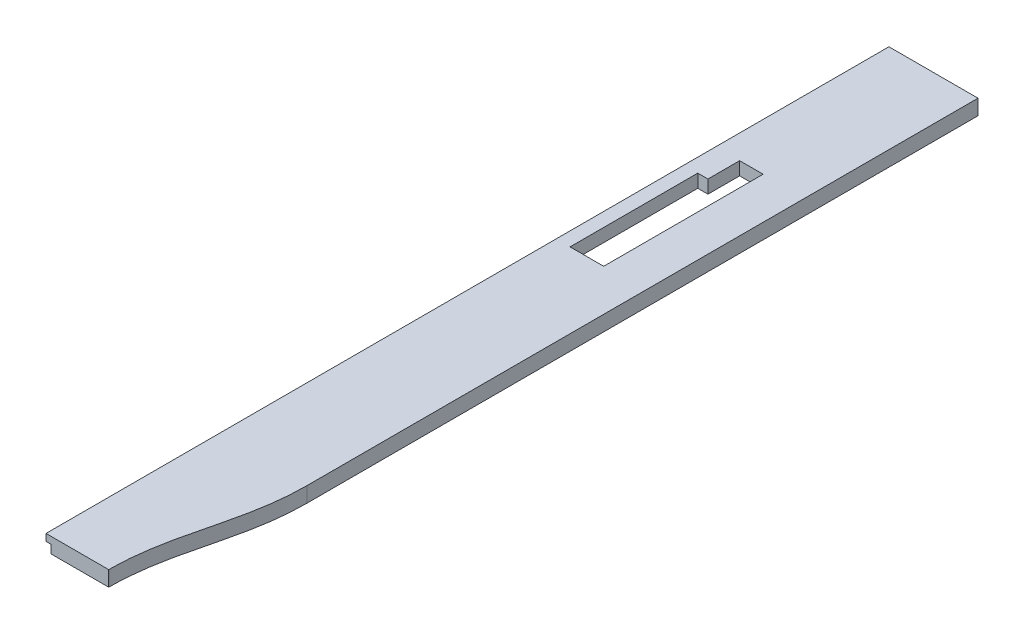
ISO-10303-21;
HEADER;
FILE_DESCRIPTION(('STEP AP214'),'2;1');
FILE_NAME('part.step','',(''),(''),'','','');
FILE_SCHEMA(('AUTOMOTIVE_DESIGN { 1 0 10303 214 1 1 1 1 }'));
ENDSEC;
DATA;
#1=APPLICATION_CONTEXT('core data for automotive mechanical design processes');
#2=APPLICATION_PROTOCOL_DEFINITION('international standard','automotive_design',2000,#1);
#3=PRODUCT_CONTEXT('',#1,'mechanical');
#4=PRODUCT('Part','Part','',(#3));
#5=PRODUCT_RELATED_PRODUCT_CATEGORY('part','',(#4));
#6=PRODUCT_DEFINITION_FORMATION('','',#4);
#7=PRODUCT_DEFINITION_CONTEXT('part definition',#1,'design');
#8=PRODUCT_DEFINITION('design','',#6,#7);
#9=PRODUCT_DEFINITION_SHAPE('','',#8);
#10=(LENGTH_UNIT() NAMED_UNIT(*) SI_UNIT(.MILLI.,.METRE.));
#11=(NAMED_UNIT(*) PLANE_ANGLE_UNIT() SI_UNIT($,.RADIAN.));
#12=(NAMED_UNIT(*) SI_UNIT($,.STERADIAN.) SOLID_ANGLE_UNIT());
#13=UNCERTAINTY_MEASURE_WITH_UNIT(LENGTH_MEASURE(1.E-05),#10,'distance_accuracy_value','');
#14=(GEOMETRIC_REPRESENTATION_CONTEXT(3) GLOBAL_UNCERTAINTY_ASSIGNED_CONTEXT((#13)) GLOBAL_UNIT_ASSIGNED_CONTEXT((#10,
#11,#12)) REPRESENTATION_CONTEXT('',''));
#15=CARTESIAN_POINT('',(0.,0.,0.));
#16=DIRECTION('',(0.,0.,1.));
#17=DIRECTION('',(1.,0.,0.));
#18=AXIS2_PLACEMENT_3D('',#15,#16,#17);
#19=CARTESIAN_POINT('',(0.,-484.,1346.36966671738));
#20=DIRECTION('',(1.,0.,0.));
#21=DIRECTION('',(0.,0.,-1.));
#22=AXIS2_PLACEMENT_3D('',#19,#20,#21);
#23=PLANE('',#22);
#24=DIRECTION('',(0.,0.,-1.));
#25=VECTOR('',#24,1.);
#26=CARTESIAN_POINT('',(0.,-506.,1346.36966671738));
#27=LINE('',#26,#25);
#28=CARTESIAN_POINT('',(0.,-506.,1004.));
#29=VERTEX_POINT('',#28);
#30=CARTESIAN_POINT('',(0.,-506.,0.));
#31=VERTEX_POINT('',#30);
#32=EDGE_CURVE('E391',#29,#31,#27,.T.);
#33=ORIENTED_EDGE('',*,*,#32,.F.);
#34=DIRECTION('',(0.,-1.,0.));
#35=VECTOR('',#34,1.);
#36=CARTESIAN_POINT('',(0.,-506.,1004.));
#37=LINE('',#36,#35);
#38=CARTESIAN_POINT('',(0.,-494.,1004.));
#39=VERTEX_POINT('',#38);
#40=EDGE_CURVE('E291',#39,#29,#37,.T.);
#41=ORIENTED_EDGE('',*,*,#40,.F.);
#42=DIRECTION('',(0.,0.,-1.));
#43=VECTOR('',#42,1.);
#44=CARTESIAN_POINT('',(0.,-494.,1004.));
#45=LINE('',#44,#43);
#46=CARTESIAN_POINT('',(0.,-494.,1216.));
#47=VERTEX_POINT('',#46);
#48=EDGE_CURVE('E310',#47,#39,#45,.T.);
#49=ORIENTED_EDGE('',*,*,#48,.F.);
#50=DIRECTION('',(0.,1.,0.));
#51=VECTOR('',#50,1.);
#52=CARTESIAN_POINT('',(0.,-484.,1216.));
#53=LINE('',#52,#51);
#54=CARTESIAN_POINT('',(0.,-484.,1216.));
#55=VERTEX_POINT('',#54);
#56=EDGE_CURVE('E40',#47,#55,#53,.T.);
#57=ORIENTED_EDGE('',*,*,#56,.T.);
#58=DIRECTION('',(0.,0.,-1.));
#59=VECTOR('',#58,1.);
#60=CARTESIAN_POINT('',(0.,-484.,1346.36966671738));
#61=LINE('',#60,#59);
#62=CARTESIAN_POINT('',(0.,-484.,0.));
#63=VERTEX_POINT('',#62);
#64=EDGE_CURVE('E640',#55,#63,#61,.T.);
#65=ORIENTED_EDGE('',*,*,#64,.T.);
#66=DIRECTION('',(0.,-1.,0.));
#67=VECTOR('',#66,1.);
#68=CARTESIAN_POINT('',(0.,-484.,0.));
#69=LINE('',#68,#67);
#70=EDGE_CURVE('E658',#63,#31,#69,.T.);
#71=ORIENTED_EDGE('',*,*,#70,.T.);
#72=EDGE_LOOP('',(#33,#41,#49,#57,#65,#71));
#73=FACE_BOUND('',#72,.T.);
#74=ADVANCED_FACE('F33',(#73),#23,.F.);
#75=CARTESIAN_POINT('',(0.,-506.,1346.36966671738));
#76=DIRECTION('',(0.,1.,0.));
#77=DIRECTION('',(0.,0.,1.));
#78=AXIS2_PLACEMENT_3D('',#75,#76,#77);
#79=PLANE('',#78);
#80=DIRECTION('',(0.,0.,-1.));
#81=VECTOR('',#80,1.);
#82=CARTESIAN_POINT('',(10.,-506.,480.));
#83=LINE('',#82,#81);
#84=CARTESIAN_POINT('',(10.,-506.,480.));
#85=VERTEX_POINT('',#84);
#86=CARTESIAN_POINT('',(10.,-506.,250.));
#87=VERTEX_POINT('',#86);
#88=EDGE_CURVE('E269',#85,#87,#83,.T.);
#89=ORIENTED_EDGE('',*,*,#88,.F.);
#90=CARTESIAN_POINT('',(20.,-506.,480.));
#91=DIRECTION('',(0.,-1.,0.));
#92=DIRECTION('',(0.,0.,-1.));
#93=AXIS2_PLACEMENT_3D('',#90,#91,#92);
#94=CIRCLE('',#93,10.);
#95=CARTESIAN_POINT('',(20.0000000000001,-506.,490.));
#96=VERTEX_POINT('',#95);
#97=EDGE_CURVE('E234',#96,#85,#94,.T.);
#98=ORIENTED_EDGE('',*,*,#97,.F.);
#99=DIRECTION('',(-1.,0.,0.));
#100=VECTOR('',#99,1.);
#101=CARTESIAN_POINT('',(68.4999999999996,-506.,490.));
#102=LINE('',#101,#100);
#103=CARTESIAN_POINT('',(68.4999999999996,-506.,490.));
#104=VERTEX_POINT('',#103);
#105=EDGE_CURVE('E246',#104,#96,#102,.T.);
#106=ORIENTED_EDGE('',*,*,#105,.F.);
#107=CARTESIAN_POINT('',(68.4999999999997,-506.,480.));
#108=DIRECTION('',(0.,-1.,0.));
#109=DIRECTION('',(0.,0.,-1.));
#110=AXIS2_PLACEMENT_3D('',#107,#108,#109);
#111=CIRCLE('',#110,10.);
#112=CARTESIAN_POINT('',(78.4999999999997,-506.,480.));
#113=VERTEX_POINT('',#112);
#114=EDGE_CURVE('E284',#113,#104,#111,.T.);
#115=ORIENTED_EDGE('',*,*,#114,.F.);
#116=DIRECTION('',(0.,0.,1.));
#117=VECTOR('',#116,1.);
#118=CARTESIAN_POINT('',(78.4999999999997,-506.,250.));
#119=LINE('',#118,#117);
#120=CARTESIAN_POINT('',(78.4999999999997,-506.,250.));
#121=VERTEX_POINT('',#120);
#122=EDGE_CURVE('E281',#121,#113,#119,.T.);
#123=ORIENTED_EDGE('',*,*,#122,.F.);
#124=CARTESIAN_POINT('',(68.4999999999997,-506.,250.));
#125=DIRECTION('',(0.,-1.,0.));
#126=DIRECTION('',(0.,0.,-1.));
#127=AXIS2_PLACEMENT_3D('',#124,#125,#126);
#128=CIRCLE('',#127,10.);
#129=CARTESIAN_POINT('',(68.4999999999996,-506.,240.));
#130=VERTEX_POINT('',#129);
#131=EDGE_CURVE('E278',#130,#121,#128,.T.);
#132=ORIENTED_EDGE('',*,*,#131,.F.);
#133=DIRECTION('',(1.,0.,0.));
#134=VECTOR('',#133,1.);
#135=CARTESIAN_POINT('',(20.0000000000001,-506.,240.));
#136=LINE('',#135,#134);
#137=CARTESIAN_POINT('',(20.0000000000001,-506.,240.));
#138=VERTEX_POINT('',#137);
#139=EDGE_CURVE('E275',#138,#130,#136,.T.);
#140=ORIENTED_EDGE('',*,*,#139,.F.);
#141=CARTESIAN_POINT('',(20.0000000000001,-506.,250.));
#142=DIRECTION('',(0.,-1.,0.));
#143=DIRECTION('',(0.,0.,-1.));
#144=AXIS2_PLACEMENT_3D('',#141,#142,#143);
#145=CIRCLE('',#144,10.);
#146=EDGE_CURVE('E272',#87,#138,#145,.T.);
#147=ORIENTED_EDGE('',*,*,#146,.F.);
#148=EDGE_LOOP('',(#89,#98,#106,#115,#123,#132,#140,#147));
#149=FACE_BOUND('',#148,.T.);
#150=DIRECTION('',(0.,0.,1.));
#151=VECTOR('',#150,1.);
#152=CARTESIAN_POINT('',(7.00000000000006,-506.,1004.));
#153=LINE('',#152,#151);
#154=CARTESIAN_POINT('',(7.00000000000006,-506.,1004.));
#155=VERTEX_POINT('',#154);
#156=CARTESIAN_POINT('',(7.00000000000007,-506.,1216.));
#157=VERTEX_POINT('',#156);
#158=EDGE_CURVE('E309',#155,#157,#153,.T.);
#159=ORIENTED_EDGE('',*,*,#158,.F.);
#160=DIRECTION('',(-1.,0.,0.));
#161=VECTOR('',#160,1.);
#162=CARTESIAN_POINT('',(7.00000000000006,-506.,1004.));
#163=LINE('',#162,#161);
#164=EDGE_CURVE('E317',#155,#29,#163,.T.);
#165=ORIENTED_EDGE('',*,*,#164,.T.);
#166=ORIENTED_EDGE('',*,*,#32,.T.);
#167=DIRECTION('',(1.,0.,0.));
#168=VECTOR('',#167,1.);
#169=CARTESIAN_POINT('',(0.,-506.,0.));
#170=LINE('',#169,#168);
#171=CARTESIAN_POINT('',(128.5,-506.,0.));
#172=VERTEX_POINT('',#171);
#173=EDGE_CURVE('E660',#31,#172,#170,.T.);
#174=ORIENTED_EDGE('',*,*,#173,.T.);
#175=DIRECTION('',(0.,0.,-1.));
#176=VECTOR('',#175,1.);
#177=CARTESIAN_POINT('',(128.5,-506.,1346.36966671738));
#178=LINE('',#177,#176);
#179=CARTESIAN_POINT('',(128.5,-506.,968.));
#180=VERTEX_POINT('',#179);
#181=EDGE_CURVE('E646',#180,#172,#178,.T.);
#182=ORIENTED_EDGE('',*,*,#181,.F.);
#183=CARTESIAN_POINT('',(128.5,-506.,968.));
#184=CARTESIAN_POINT('',(128.5,-506.,1061.33333333333));
#185=CARTESIAN_POINT('',(90.4999999999999,-506.,1122.56666666667));
#186=CARTESIAN_POINT('',(90.4999999999999,-506.,1215.9));
#187=B_SPLINE_CURVE_WITH_KNOTS('',3,(#183,#184,#185,#186),.UNSPECIFIED.,.F.,.F.,(4,4),(0.,1.),.UNSPECIFIED.);
#188=CARTESIAN_POINT('',(90.4999999999999,-506.,1215.9));
#189=VERTEX_POINT('',#188);
#190=EDGE_CURVE('E328',#180,#189,#187,.T.);
#191=ORIENTED_EDGE('',*,*,#190,.T.);
#192=DIRECTION('',(0.,0.,1.));
#193=VECTOR('',#192,1.);
#194=CARTESIAN_POINT('',(90.4999999999999,-506.,1215.9));
#195=LINE('',#194,#193);
#196=CARTESIAN_POINT('',(90.4999999999999,-506.,1216.));
#197=VERTEX_POINT('',#196);
#198=EDGE_CURVE('E334',#189,#197,#195,.T.);
#199=ORIENTED_EDGE('',*,*,#198,.T.);
#200=DIRECTION('',(-1.,0.,0.));
#201=VECTOR('',#200,1.);
#202=CARTESIAN_POINT('',(0.,-506.,1216.));
#203=LINE('',#202,#201);
#204=EDGE_CURVE('E377',#197,#157,#203,.T.);
#205=ORIENTED_EDGE('',*,*,#204,.T.);
#206=EDGE_LOOP('',(#159,#165,#166,#174,#182,#191,#199,#205));
#207=FACE_BOUND('',#206,.T.);
#208=ADVANCED_FACE('F360',(#149,#207),#79,.F.);
#209=CARTESIAN_POINT('',(128.5,-484.,1346.36966671738));
#210=DIRECTION('',(1.,0.,0.));
#211=DIRECTION('',(0.,0.,-1.));
#212=AXIS2_PLACEMENT_3D('',#209,#210,#211);
#213=PLANE('',#212);
#214=DIRECTION('',(0.,1.,0.));
#215=VECTOR('',#214,1.);
#216=CARTESIAN_POINT('',(128.5,-506.,968.));
#217=LINE('',#216,#215);
#218=CARTESIAN_POINT('',(128.5,-484.,968.));
#219=VERTEX_POINT('',#218);
#220=EDGE_CURVE('E637',#180,#219,#217,.T.);
#221=ORIENTED_EDGE('',*,*,#220,.F.);
#222=ORIENTED_EDGE('',*,*,#181,.T.);
#223=DIRECTION('',(0.,-1.,0.));
#224=VECTOR('',#223,1.);
#225=CARTESIAN_POINT('',(128.5,-484.,0.));
#226=LINE('',#225,#224);
#227=CARTESIAN_POINT('',(128.5,-484.,0.));
#228=VERTEX_POINT('',#227);
#229=EDGE_CURVE('E648',#228,#172,#226,.T.);
#230=ORIENTED_EDGE('',*,*,#229,.F.);
#231=DIRECTION('',(0.,0.,-1.));
#232=VECTOR('',#231,1.);
#233=CARTESIAN_POINT('',(128.5,-484.,1346.36966671738));
#234=LINE('',#233,#232);
#235=EDGE_CURVE('E644',#219,#228,#234,.T.);
#236=ORIENTED_EDGE('',*,*,#235,.F.);
#237=EDGE_LOOP('',(#221,#222,#230,#236));
#238=FACE_BOUND('',#237,.T.);
#239=ADVANCED_FACE('F358',(#238),#213,.T.);
#240=CARTESIAN_POINT('',(0.,-484.,1346.36966671738));
#241=DIRECTION('',(0.,1.,0.));
#242=DIRECTION('',(0.,0.,1.));
#243=AXIS2_PLACEMENT_3D('',#240,#241,#242);
#244=PLANE('',#243);
#245=DIRECTION('',(0.,0.,1.));
#246=VECTOR('',#245,1.);
#247=CARTESIAN_POINT('',(68.4999999999997,-484.,250.));
#248=LINE('',#247,#246);
#249=CARTESIAN_POINT('',(68.4999999999997,-484.,250.));
#250=VERTEX_POINT('',#249);
#251=CARTESIAN_POINT('',(68.4999999999997,-484.,480.));
#252=VERTEX_POINT('',#251);
#253=EDGE_CURVE('E191',#250,#252,#248,.T.);
#254=ORIENTED_EDGE('',*,*,#253,.T.);
#255=DIRECTION('',(-1.,0.,0.));
#256=VECTOR('',#255,1.);
#257=CARTESIAN_POINT('',(68.4999999999997,-484.,480.));
#258=LINE('',#257,#256);
#259=CARTESIAN_POINT('',(20.,-484.,480.));
#260=VERTEX_POINT('',#259);
#261=EDGE_CURVE('E202',#252,#260,#258,.T.);
#262=ORIENTED_EDGE('',*,*,#261,.T.);
#263=DIRECTION('',(0.,0.,-1.));
#264=VECTOR('',#263,1.);
#265=CARTESIAN_POINT('',(20.,-484.,480.));
#266=LINE('',#265,#264);
#267=CARTESIAN_POINT('',(20.0000000000001,-484.,295.75));
#268=VERTEX_POINT('',#267);
#269=EDGE_CURVE('E55',#260,#268,#266,.T.);
#270=ORIENTED_EDGE('',*,*,#269,.T.);
#271=DIRECTION('',(1.,0.,0.));
#272=VECTOR('',#271,1.);
#273=CARTESIAN_POINT('',(20.0000000000001,-484.,295.75));
#274=LINE('',#273,#272);
#275=CARTESIAN_POINT('',(34.65,-484.,295.75));
#276=VERTEX_POINT('',#275);
#277=EDGE_CURVE('E216',#268,#276,#274,.T.);
#278=ORIENTED_EDGE('',*,*,#277,.T.);
#279=DIRECTION('',(0.,0.,-1.));
#280=VECTOR('',#279,1.);
#281=CARTESIAN_POINT('',(34.65,-484.,295.75));
#282=LINE('',#281,#280);
#283=CARTESIAN_POINT('',(34.6500000000001,-484.,250.));
#284=VERTEX_POINT('',#283);
#285=EDGE_CURVE('E219',#276,#284,#282,.T.);
#286=ORIENTED_EDGE('',*,*,#285,.T.);
#287=DIRECTION('',(1.,0.,0.));
#288=VECTOR('',#287,1.);
#289=CARTESIAN_POINT('',(34.6500000000001,-484.,250.));
#290=LINE('',#289,#288);
#291=EDGE_CURVE('E199',#284,#250,#290,.T.);
#292=ORIENTED_EDGE('',*,*,#291,.T.);
#293=EDGE_LOOP('',(#254,#262,#270,#278,#286,#292));
#294=FACE_BOUND('',#293,.T.);
#295=CARTESIAN_POINT('',(128.5,-484.,968.));
#296=CARTESIAN_POINT('',(128.5,-484.,1061.33333333333));
#297=CARTESIAN_POINT('',(90.4999999999999,-484.,1122.56666666667));
#298=CARTESIAN_POINT('',(90.4999999999999,-484.,1215.9));
#299=B_SPLINE_CURVE_WITH_KNOTS('',3,(#295,#296,#297,#298),.UNSPECIFIED.,.F.,.F.,(4,4),(0.,1.),.UNSPECIFIED.);
#300=CARTESIAN_POINT('',(90.4999999999999,-484.,1215.9));
#301=VERTEX_POINT('',#300);
#302=EDGE_CURVE('E323',#219,#301,#299,.T.);
#303=ORIENTED_EDGE('',*,*,#302,.F.);
#304=ORIENTED_EDGE('',*,*,#235,.T.);
#305=DIRECTION('',(1.,0.,0.));
#306=VECTOR('',#305,1.);
#307=CARTESIAN_POINT('',(0.,-484.,0.));
#308=LINE('',#307,#306);
#309=EDGE_CURVE('E642',#63,#228,#308,.T.);
#310=ORIENTED_EDGE('',*,*,#309,.F.);
#311=ORIENTED_EDGE('',*,*,#64,.F.);
#312=DIRECTION('',(-1.,0.,0.));
#313=VECTOR('',#312,1.);
#314=CARTESIAN_POINT('',(0.,-484.,1216.));
#315=LINE('',#314,#313);
#316=CARTESIAN_POINT('',(90.4999999999999,-484.,1216.));
#317=VERTEX_POINT('',#316);
#318=EDGE_CURVE('E11',#317,#55,#315,.T.);
#319=ORIENTED_EDGE('',*,*,#318,.F.);
#320=DIRECTION('',(0.,0.,1.));
#321=VECTOR('',#320,1.);
#322=CARTESIAN_POINT('',(90.4999999999999,-484.,1215.9));
#323=LINE('',#322,#321);
#324=EDGE_CURVE('E335',#301,#317,#323,.T.);
#325=ORIENTED_EDGE('',*,*,#324,.F.);
#326=EDGE_LOOP('',(#303,#304,#310,#311,#319,#325));
#327=FACE_BOUND('',#326,.T.);
#328=ADVANCED_FACE('F206',(#294,#327),#244,.T.);
#329=CARTESIAN_POINT('',(0.,0.,0.));
#330=DIRECTION('',(0.,0.,1.));
#331=DIRECTION('',(1.,0.,0.));
#332=AXIS2_PLACEMENT_3D('',#329,#330,#331);
#333=PLANE('',#332);
#334=ORIENTED_EDGE('',*,*,#70,.F.);
#335=ORIENTED_EDGE('',*,*,#309,.T.);
#336=ORIENTED_EDGE('',*,*,#229,.T.);
#337=ORIENTED_EDGE('',*,*,#173,.F.);
#338=EDGE_LOOP('',(#334,#335,#336,#337));
#339=FACE_BOUND('',#338,.T.);
#340=ADVANCED_FACE('F351',(#339),#333,.F.);
#341=CARTESIAN_POINT('',(80.4999999999999,-222.999999999999,1216.));
#342=DIRECTION('',(0.,0.,-1.));
#343=DIRECTION('',(0.,1.,0.));
#344=AXIS2_PLACEMENT_3D('',#341,#342,#343);
#345=PLANE('',#344);
#346=ORIENTED_EDGE('',*,*,#56,.F.);
#347=DIRECTION('',(-1.,0.,0.));
#348=VECTOR('',#347,1.);
#349=CARTESIAN_POINT('',(7.00000000000006,-494.,1216.));
#350=LINE('',#349,#348);
#351=CARTESIAN_POINT('',(7.00000000000006,-494.,1216.));
#352=VERTEX_POINT('',#351);
#353=EDGE_CURVE('E324',#352,#47,#350,.T.);
#354=ORIENTED_EDGE('',*,*,#353,.F.);
#355=DIRECTION('',(0.,1.,0.));
#356=VECTOR('',#355,1.);
#357=CARTESIAN_POINT('',(7.00000000000006,-506.,1216.));
#358=LINE('',#357,#356);
#359=EDGE_CURVE('E312',#157,#352,#358,.T.);
#360=ORIENTED_EDGE('',*,*,#359,.F.);
#361=ORIENTED_EDGE('',*,*,#204,.F.);
#362=DIRECTION('',(0.,1.,0.));
#363=VECTOR('',#362,1.);
#364=CARTESIAN_POINT('',(90.4999999999999,-506.,1216.));
#365=LINE('',#364,#363);
#366=EDGE_CURVE('E630',#197,#317,#365,.T.);
#367=ORIENTED_EDGE('',*,*,#366,.T.);
#368=ORIENTED_EDGE('',*,*,#318,.T.);
#369=EDGE_LOOP('',(#346,#354,#360,#361,#367,#368));
#370=FACE_BOUND('',#369,.T.);
#371=ADVANCED_FACE('F346',(#370),#345,.F.);
#372=DIRECTION('',(0.,1.,0.));
#373=VECTOR('',#372,1.);
#374=SURFACE_OF_LINEAR_EXTRUSION('',#187,#373);
#375=ORIENTED_EDGE('',*,*,#302,.T.);
#376=DIRECTION('',(0.,1.,0.));
#377=VECTOR('',#376,1.);
#378=CARTESIAN_POINT('',(90.4999999999999,-506.,1215.9));
#379=LINE('',#378,#377);
#380=EDGE_CURVE('E631',#189,#301,#379,.T.);
#381=ORIENTED_EDGE('',*,*,#380,.F.);
#382=ORIENTED_EDGE('',*,*,#190,.F.);
#383=ORIENTED_EDGE('',*,*,#220,.T.);
#384=EDGE_LOOP('',(#375,#381,#382,#383));
#385=FACE_BOUND('',#384,.T.);
#386=ADVANCED_FACE('F341',(#385),#374,.F.);
#387=CARTESIAN_POINT('',(90.4999999999999,-506.,1215.9));
#388=DIRECTION('',(-1.,0.,0.));
#389=DIRECTION('',(0.,0.,1.));
#390=AXIS2_PLACEMENT_3D('',#387,#388,#389);
#391=PLANE('',#390);
#392=ORIENTED_EDGE('',*,*,#324,.T.);
#393=ORIENTED_EDGE('',*,*,#366,.F.);
#394=ORIENTED_EDGE('',*,*,#198,.F.);
#395=ORIENTED_EDGE('',*,*,#380,.T.);
#396=EDGE_LOOP('',(#392,#393,#394,#395));
#397=FACE_BOUND('',#396,.T.);
#398=ADVANCED_FACE('F345',(#397),#391,.F.);
#399=CARTESIAN_POINT('',(7.00000000000006,-506.,1004.));
#400=DIRECTION('',(0.,0.,-1.));
#401=DIRECTION('',(-1.,0.,0.));
#402=AXIS2_PLACEMENT_3D('',#399,#400,#401);
#403=PLANE('',#402);
#404=ORIENTED_EDGE('',*,*,#40,.T.);
#405=ORIENTED_EDGE('',*,*,#164,.F.);
#406=DIRECTION('',(0.,-1.,0.));
#407=VECTOR('',#406,1.);
#408=CARTESIAN_POINT('',(7.00000000000006,-506.,1004.));
#409=LINE('',#408,#407);
#410=CARTESIAN_POINT('',(7.00000000000006,-494.,1004.));
#411=VERTEX_POINT('',#410);
#412=EDGE_CURVE('E306',#411,#155,#409,.T.);
#413=ORIENTED_EDGE('',*,*,#412,.F.);
#414=DIRECTION('',(-1.,0.,0.));
#415=VECTOR('',#414,1.);
#416=CARTESIAN_POINT('',(7.00000000000006,-494.,1004.));
#417=LINE('',#416,#415);
#418=EDGE_CURVE('E321',#411,#39,#417,.T.);
#419=ORIENTED_EDGE('',*,*,#418,.T.);
#420=EDGE_LOOP('',(#404,#405,#413,#419));
#421=FACE_BOUND('',#420,.T.);
#422=ADVANCED_FACE('F393',(#421),#403,.F.);
#423=CARTESIAN_POINT('',(7.00000000000006,-494.,1004.));
#424=DIRECTION('',(0.,1.,0.));
#425=DIRECTION('',(-1.,0.,0.));
#426=AXIS2_PLACEMENT_3D('',#423,#424,#425);
#427=PLANE('',#426);
#428=ORIENTED_EDGE('',*,*,#48,.T.);
#429=ORIENTED_EDGE('',*,*,#418,.F.);
#430=DIRECTION('',(0.,0.,-1.));
#431=VECTOR('',#430,1.);
#432=CARTESIAN_POINT('',(7.00000000000006,-494.,1004.));
#433=LINE('',#432,#431);
#434=EDGE_CURVE('E314',#352,#411,#433,.T.);
#435=ORIENTED_EDGE('',*,*,#434,.F.);
#436=ORIENTED_EDGE('',*,*,#353,.T.);
#437=EDGE_LOOP('',(#428,#429,#435,#436));
#438=FACE_BOUND('',#437,.T.);
#439=ADVANCED_FACE('F388',(#438),#427,.F.);
#440=CARTESIAN_POINT('',(7.,0.,0.));
#441=DIRECTION('',(1.,0.,0.));
#442=DIRECTION('',(0.,1.,0.));
#443=AXIS2_PLACEMENT_3D('',#440,#441,#442);
#444=PLANE('',#443);
#445=ORIENTED_EDGE('',*,*,#412,.T.);
#446=ORIENTED_EDGE('',*,*,#158,.T.);
#447=ORIENTED_EDGE('',*,*,#359,.T.);
#448=ORIENTED_EDGE('',*,*,#434,.T.);
#449=EDGE_LOOP('',(#445,#446,#447,#448));
#450=FACE_BOUND('',#449,.T.);
#451=ADVANCED_FACE('F380',(#450),#444,.F.);
#452=CARTESIAN_POINT('',(20.,-503.,480.));
#453=DIRECTION('',(0.,-1.,0.));
#454=DIRECTION('',(0.,0.,-1.));
#455=AXIS2_PLACEMENT_3D('',#452,#453,#454);
#456=CYLINDRICAL_SURFACE('',#455,10.);
#457=ORIENTED_EDGE('',*,*,#97,.T.);
#458=DIRECTION('',(0.,-1.,0.));
#459=VECTOR('',#458,1.);
#460=CARTESIAN_POINT('',(10.,-503.,480.));
#461=LINE('',#460,#459);
#462=CARTESIAN_POINT('',(10.,-503.,480.));
#463=VERTEX_POINT('',#462);
#464=EDGE_CURVE('E267',#463,#85,#461,.T.);
#465=ORIENTED_EDGE('',*,*,#464,.F.);
#466=CARTESIAN_POINT('',(20.,-503.,480.));
#467=DIRECTION('',(0.,-1.,0.));
#468=DIRECTION('',(0.,0.,-1.));
#469=AXIS2_PLACEMENT_3D('',#466,#467,#468);
#470=CIRCLE('',#469,10.);
#471=CARTESIAN_POINT('',(20.0000000000001,-503.,490.));
#472=VERTEX_POINT('',#471);
#473=EDGE_CURVE('E242',#472,#463,#470,.T.);
#474=ORIENTED_EDGE('',*,*,#473,.F.);
#475=DIRECTION('',(0.,-1.,0.));
#476=VECTOR('',#475,1.);
#477=CARTESIAN_POINT('',(20.0000000000001,-503.,490.));
#478=LINE('',#477,#476);
#479=EDGE_CURVE('E289',#472,#96,#478,.T.);
#480=ORIENTED_EDGE('',*,*,#479,.T.);
#481=EDGE_LOOP('',(#457,#465,#474,#480));
#482=FACE_BOUND('',#481,.T.);
#483=ADVANCED_FACE('F404',(#482),#456,.F.);
#484=CARTESIAN_POINT('',(68.4999999999996,-503.,490.));
#485=DIRECTION('',(0.,0.,1.));
#486=DIRECTION('',(1.,0.,0.));
#487=AXIS2_PLACEMENT_3D('',#484,#485,#486);
#488=PLANE('',#487);
#489=ORIENTED_EDGE('',*,*,#105,.T.);
#490=ORIENTED_EDGE('',*,*,#479,.F.);
#491=DIRECTION('',(-1.,0.,0.));
#492=VECTOR('',#491,1.);
#493=CARTESIAN_POINT('',(68.4999999999996,-503.,490.));
#494=LINE('',#493,#492);
#495=CARTESIAN_POINT('',(68.4999999999996,-503.,490.));
#496=VERTEX_POINT('',#495);
#497=EDGE_CURVE('E264',#496,#472,#494,.T.);
#498=ORIENTED_EDGE('',*,*,#497,.F.);
#499=DIRECTION('',(0.,-1.,0.));
#500=VECTOR('',#499,1.);
#501=CARTESIAN_POINT('',(68.4999999999996,-503.,490.));
#502=LINE('',#501,#500);
#503=EDGE_CURVE('E292',#496,#104,#502,.T.);
#504=ORIENTED_EDGE('',*,*,#503,.T.);
#505=EDGE_LOOP('',(#489,#490,#498,#504));
#506=FACE_BOUND('',#505,.T.);
#507=ADVANCED_FACE('F407',(#506),#488,.F.);
#508=CARTESIAN_POINT('',(68.4999999999997,-503.,480.));
#509=DIRECTION('',(0.,-1.,0.));
#510=DIRECTION('',(0.,0.,-1.));
#511=AXIS2_PLACEMENT_3D('',#508,#509,#510);
#512=CYLINDRICAL_SURFACE('',#511,10.);
#513=ORIENTED_EDGE('',*,*,#114,.T.);
#514=ORIENTED_EDGE('',*,*,#503,.F.);
#515=CARTESIAN_POINT('',(68.4999999999997,-503.,480.));
#516=DIRECTION('',(0.,-1.,0.));
#517=DIRECTION('',(0.,0.,-1.));
#518=AXIS2_PLACEMENT_3D('',#515,#516,#517);
#519=CIRCLE('',#518,10.);
#520=CARTESIAN_POINT('',(78.4999999999997,-503.,480.));
#521=VERTEX_POINT('',#520);
#522=EDGE_CURVE('E261',#521,#496,#519,.T.);
#523=ORIENTED_EDGE('',*,*,#522,.F.);
#524=DIRECTION('',(0.,-1.,0.));
#525=VECTOR('',#524,1.);
#526=CARTESIAN_POINT('',(78.4999999999997,-503.,480.));
#527=LINE('',#526,#525);
#528=EDGE_CURVE('E294',#521,#113,#527,.T.);
#529=ORIENTED_EDGE('',*,*,#528,.T.);
#530=EDGE_LOOP('',(#513,#514,#523,#529));
#531=FACE_BOUND('',#530,.T.);
#532=ADVANCED_FACE('F429',(#531),#512,.F.);
#533=CARTESIAN_POINT('',(78.4999999999997,-503.,250.));
#534=DIRECTION('',(1.,0.,0.));
#535=DIRECTION('',(0.,0.,-1.));
#536=AXIS2_PLACEMENT_3D('',#533,#534,#535);
#537=PLANE('',#536);
#538=ORIENTED_EDGE('',*,*,#122,.T.);
#539=ORIENTED_EDGE('',*,*,#528,.F.);
#540=DIRECTION('',(0.,0.,1.));
#541=VECTOR('',#540,1.);
#542=CARTESIAN_POINT('',(78.4999999999997,-503.,250.));
#543=LINE('',#542,#541);
#544=CARTESIAN_POINT('',(78.4999999999997,-503.,250.));
#545=VERTEX_POINT('',#544);
#546=EDGE_CURVE('E258',#545,#521,#543,.T.);
#547=ORIENTED_EDGE('',*,*,#546,.F.);
#548=DIRECTION('',(0.,-1.,0.));
#549=VECTOR('',#548,1.);
#550=CARTESIAN_POINT('',(78.4999999999997,-503.,250.));
#551=LINE('',#550,#549);
#552=EDGE_CURVE('E296',#545,#121,#551,.T.);
#553=ORIENTED_EDGE('',*,*,#552,.T.);
#554=EDGE_LOOP('',(#538,#539,#547,#553));
#555=FACE_BOUND('',#554,.T.);
#556=ADVANCED_FACE('F425',(#555),#537,.F.);
#557=CARTESIAN_POINT('',(68.4999999999997,-503.,250.));
#558=DIRECTION('',(0.,-1.,0.));
#559=DIRECTION('',(0.,0.,-1.));
#560=AXIS2_PLACEMENT_3D('',#557,#558,#559);
#561=CYLINDRICAL_SURFACE('',#560,10.);
#562=ORIENTED_EDGE('',*,*,#131,.T.);
#563=ORIENTED_EDGE('',*,*,#552,.F.);
#564=CARTESIAN_POINT('',(68.4999999999997,-503.,250.));
#565=DIRECTION('',(0.,-1.,0.));
#566=DIRECTION('',(0.,0.,-1.));
#567=AXIS2_PLACEMENT_3D('',#564,#565,#566);
#568=CIRCLE('',#567,10.);
#569=CARTESIAN_POINT('',(68.4999999999996,-503.,240.));
#570=VERTEX_POINT('',#569);
#571=EDGE_CURVE('E255',#570,#545,#568,.T.);
#572=ORIENTED_EDGE('',*,*,#571,.F.);
#573=DIRECTION('',(0.,-1.,0.));
#574=VECTOR('',#573,1.);
#575=CARTESIAN_POINT('',(68.4999999999996,-503.,240.));
#576=LINE('',#575,#574);
#577=EDGE_CURVE('E298',#570,#130,#576,.T.);
#578=ORIENTED_EDGE('',*,*,#577,.T.);
#579=EDGE_LOOP('',(#562,#563,#572,#578));
#580=FACE_BOUND('',#579,.T.);
#581=ADVANCED_FACE('F421',(#580),#561,.F.);
#582=CARTESIAN_POINT('',(20.0000000000001,-503.,240.));
#583=DIRECTION('',(0.,0.,-1.));
#584=DIRECTION('',(-1.,0.,0.));
#585=AXIS2_PLACEMENT_3D('',#582,#583,#584);
#586=PLANE('',#585);
#587=ORIENTED_EDGE('',*,*,#139,.T.);
#588=ORIENTED_EDGE('',*,*,#577,.F.);
#589=DIRECTION('',(1.,0.,0.));
#590=VECTOR('',#589,1.);
#591=CARTESIAN_POINT('',(20.0000000000001,-503.,240.));
#592=LINE('',#591,#590);
#593=CARTESIAN_POINT('',(20.0000000000001,-503.,240.));
#594=VERTEX_POINT('',#593);
#595=EDGE_CURVE('E252',#594,#570,#592,.T.);
#596=ORIENTED_EDGE('',*,*,#595,.F.);
#597=DIRECTION('',(0.,-1.,0.));
#598=VECTOR('',#597,1.);
#599=CARTESIAN_POINT('',(20.0000000000001,-503.,240.));
#600=LINE('',#599,#598);
#601=EDGE_CURVE('E300',#594,#138,#600,.T.);
#602=ORIENTED_EDGE('',*,*,#601,.T.);
#603=EDGE_LOOP('',(#587,#588,#596,#602));
#604=FACE_BOUND('',#603,.T.);
#605=ADVANCED_FACE('F417',(#604),#586,.F.);
#606=CARTESIAN_POINT('',(20.0000000000001,-503.,250.));
#607=DIRECTION('',(0.,-1.,0.));
#608=DIRECTION('',(0.,0.,-1.));
#609=AXIS2_PLACEMENT_3D('',#606,#607,#608);
#610=CYLINDRICAL_SURFACE('',#609,10.);
#611=ORIENTED_EDGE('',*,*,#146,.T.);
#612=ORIENTED_EDGE('',*,*,#601,.F.);
#613=CARTESIAN_POINT('',(20.0000000000001,-503.,250.));
#614=DIRECTION('',(0.,-1.,0.));
#615=DIRECTION('',(0.,0.,-1.));
#616=AXIS2_PLACEMENT_3D('',#613,#614,#615);
#617=CIRCLE('',#616,10.);
#618=CARTESIAN_POINT('',(10.,-503.,250.));
#619=VERTEX_POINT('',#618);
#620=EDGE_CURVE('E249',#619,#594,#617,.T.);
#621=ORIENTED_EDGE('',*,*,#620,.F.);
#622=DIRECTION('',(0.,-1.,0.));
#623=VECTOR('',#622,1.);
#624=CARTESIAN_POINT('',(10.,-503.,250.));
#625=LINE('',#624,#623);
#626=EDGE_CURVE('E302',#619,#87,#625,.T.);
#627=ORIENTED_EDGE('',*,*,#626,.T.);
#628=EDGE_LOOP('',(#611,#612,#621,#627));
#629=FACE_BOUND('',#628,.T.);
#630=ADVANCED_FACE('F413',(#629),#610,.F.);
#631=CARTESIAN_POINT('',(10.,-503.,480.));
#632=DIRECTION('',(-1.,0.,0.));
#633=DIRECTION('',(0.,0.,1.));
#634=AXIS2_PLACEMENT_3D('',#631,#632,#633);
#635=PLANE('',#634);
#636=ORIENTED_EDGE('',*,*,#88,.T.);
#637=ORIENTED_EDGE('',*,*,#626,.F.);
#638=DIRECTION('',(0.,0.,-1.));
#639=VECTOR('',#638,1.);
#640=CARTESIAN_POINT('',(10.,-503.,480.));
#641=LINE('',#640,#639);
#642=EDGE_CURVE('E245',#463,#619,#641,.T.);
#643=ORIENTED_EDGE('',*,*,#642,.F.);
#644=ORIENTED_EDGE('',*,*,#464,.T.);
#645=EDGE_LOOP('',(#636,#637,#643,#644));
#646=FACE_BOUND('',#645,.T.);
#647=ADVANCED_FACE('F409',(#646),#635,.F.);
#648=CARTESIAN_POINT('',(20.,-503.,480.));
#649=DIRECTION('',(0.,-1.,0.));
#650=DIRECTION('',(0.,0.,-1.));
#651=AXIS2_PLACEMENT_3D('',#648,#649,#650);
#652=PLANE('',#651);
#653=DIRECTION('',(0.,0.,1.));
#654=VECTOR('',#653,1.);
#655=CARTESIAN_POINT('',(68.4999999999997,-503.,250.));
#656=LINE('',#655,#654);
#657=CARTESIAN_POINT('',(68.4999999999997,-503.,250.));
#658=VERTEX_POINT('',#657);
#659=CARTESIAN_POINT('',(68.4999999999997,-503.,480.));
#660=VERTEX_POINT('',#659);
#661=EDGE_CURVE('E194',#658,#660,#656,.T.);
#662=ORIENTED_EDGE('',*,*,#661,.F.);
#663=DIRECTION('',(1.,0.,0.));
#664=VECTOR('',#663,1.);
#665=CARTESIAN_POINT('',(34.6500000000001,-503.,250.));
#666=LINE('',#665,#664);
#667=CARTESIAN_POINT('',(34.6500000000001,-503.,250.));
#668=VERTEX_POINT('',#667);
#669=EDGE_CURVE('E210',#668,#658,#666,.T.);
#670=ORIENTED_EDGE('',*,*,#669,.F.);
#671=DIRECTION('',(0.,0.,-1.));
#672=VECTOR('',#671,1.);
#673=CARTESIAN_POINT('',(34.65,-503.,295.75));
#674=LINE('',#673,#672);
#675=CARTESIAN_POINT('',(34.65,-503.,295.75));
#676=VERTEX_POINT('',#675);
#677=EDGE_CURVE('E47',#676,#668,#674,.T.);
#678=ORIENTED_EDGE('',*,*,#677,.F.);
#679=DIRECTION('',(1.,0.,0.));
#680=VECTOR('',#679,1.);
#681=CARTESIAN_POINT('',(20.0000000000001,-503.,295.75));
#682=LINE('',#681,#680);
#683=CARTESIAN_POINT('',(20.0000000000001,-503.,295.75));
#684=VERTEX_POINT('',#683);
#685=EDGE_CURVE('E228',#684,#676,#682,.T.);
#686=ORIENTED_EDGE('',*,*,#685,.F.);
#687=DIRECTION('',(0.,0.,-1.));
#688=VECTOR('',#687,1.);
#689=CARTESIAN_POINT('',(20.,-503.,480.));
#690=LINE('',#689,#688);
#691=CARTESIAN_POINT('',(20.,-503.,480.));
#692=VERTEX_POINT('',#691);
#693=EDGE_CURVE('E225',#692,#684,#690,.T.);
#694=ORIENTED_EDGE('',*,*,#693,.F.);
#695=DIRECTION('',(-1.,0.,0.));
#696=VECTOR('',#695,1.);
#697=CARTESIAN_POINT('',(68.4999999999997,-503.,480.));
#698=LINE('',#697,#696);
#699=EDGE_CURVE('E223',#660,#692,#698,.T.);
#700=ORIENTED_EDGE('',*,*,#699,.F.);
#701=EDGE_LOOP('',(#662,#670,#678,#686,#694,#700));
#702=FACE_BOUND('',#701,.T.);
#703=ORIENTED_EDGE('',*,*,#473,.T.);
#704=ORIENTED_EDGE('',*,*,#642,.T.);
#705=ORIENTED_EDGE('',*,*,#620,.T.);
#706=ORIENTED_EDGE('',*,*,#595,.T.);
#707=ORIENTED_EDGE('',*,*,#571,.T.);
#708=ORIENTED_EDGE('',*,*,#546,.T.);
#709=ORIENTED_EDGE('',*,*,#522,.T.);
#710=ORIENTED_EDGE('',*,*,#497,.T.);
#711=EDGE_LOOP('',(#703,#704,#705,#706,#707,#708,#709,#710));
#712=FACE_BOUND('',#711,.T.);
#713=ADVANCED_FACE('F412',(#702,#712),#652,.T.);
#714=CARTESIAN_POINT('',(68.4999999999997,-484.,250.));
#715=DIRECTION('',(1.,0.,0.));
#716=DIRECTION('',(0.,0.,-1.));
#717=AXIS2_PLACEMENT_3D('',#714,#715,#716);
#718=PLANE('',#717);
#719=ORIENTED_EDGE('',*,*,#661,.T.);
#720=DIRECTION('',(0.,-1.,0.));
#721=VECTOR('',#720,1.);
#722=CARTESIAN_POINT('',(68.4999999999997,-484.,480.));
#723=LINE('',#722,#721);
#724=EDGE_CURVE('E187',#252,#660,#723,.T.);
#725=ORIENTED_EDGE('',*,*,#724,.F.);
#726=ORIENTED_EDGE('',*,*,#253,.F.);
#727=DIRECTION('',(0.,-1.,0.));
#728=VECTOR('',#727,1.);
#729=CARTESIAN_POINT('',(68.4999999999997,-484.,250.));
#730=LINE('',#729,#728);
#731=EDGE_CURVE('E232',#250,#658,#730,.T.);
#732=ORIENTED_EDGE('',*,*,#731,.T.);
#733=EDGE_LOOP('',(#719,#725,#726,#732));
#734=FACE_BOUND('',#733,.T.);
#735=ADVANCED_FACE('F189',(#734),#718,.F.);
#736=CARTESIAN_POINT('',(34.6500000000001,-484.,250.));
#737=DIRECTION('',(0.,0.,-1.));
#738=DIRECTION('',(-1.,0.,0.));
#739=AXIS2_PLACEMENT_3D('',#736,#737,#738);
#740=PLANE('',#739);
#741=ORIENTED_EDGE('',*,*,#669,.T.);
#742=ORIENTED_EDGE('',*,*,#731,.F.);
#743=ORIENTED_EDGE('',*,*,#291,.F.);
#744=DIRECTION('',(0.,-1.,0.));
#745=VECTOR('',#744,1.);
#746=CARTESIAN_POINT('',(34.6500000000001,-484.,250.));
#747=LINE('',#746,#745);
#748=EDGE_CURVE('E235',#284,#668,#747,.T.);
#749=ORIENTED_EDGE('',*,*,#748,.T.);
#750=EDGE_LOOP('',(#741,#742,#743,#749));
#751=FACE_BOUND('',#750,.T.);
#752=ADVANCED_FACE('F442',(#751),#740,.F.);
#753=CARTESIAN_POINT('',(34.65,-484.,295.75));
#754=DIRECTION('',(-1.,0.,0.));
#755=DIRECTION('',(0.,0.,1.));
#756=AXIS2_PLACEMENT_3D('',#753,#754,#755);
#757=PLANE('',#756);
#758=ORIENTED_EDGE('',*,*,#677,.T.);
#759=ORIENTED_EDGE('',*,*,#748,.F.);
#760=ORIENTED_EDGE('',*,*,#285,.F.);
#761=DIRECTION('',(0.,-1.,0.));
#762=VECTOR('',#761,1.);
#763=CARTESIAN_POINT('',(34.65,-484.,295.75));
#764=LINE('',#763,#762);
#765=EDGE_CURVE('E237',#276,#676,#764,.T.);
#766=ORIENTED_EDGE('',*,*,#765,.T.);
#767=EDGE_LOOP('',(#758,#759,#760,#766));
#768=FACE_BOUND('',#767,.T.);
#769=ADVANCED_FACE('F451',(#768),#757,.F.);
#770=CARTESIAN_POINT('',(20.0000000000001,-484.,295.75));
#771=DIRECTION('',(0.,0.,-1.));
#772=DIRECTION('',(-1.,0.,0.));
#773=AXIS2_PLACEMENT_3D('',#770,#771,#772);
#774=PLANE('',#773);
#775=ORIENTED_EDGE('',*,*,#685,.T.);
#776=ORIENTED_EDGE('',*,*,#765,.F.);
#777=ORIENTED_EDGE('',*,*,#277,.F.);
#778=DIRECTION('',(0.,-1.,0.));
#779=VECTOR('',#778,1.);
#780=CARTESIAN_POINT('',(20.0000000000001,-484.,295.75));
#781=LINE('',#780,#779);
#782=EDGE_CURVE('E239',#268,#684,#781,.T.);
#783=ORIENTED_EDGE('',*,*,#782,.T.);
#784=EDGE_LOOP('',(#775,#776,#777,#783));
#785=FACE_BOUND('',#784,.T.);
#786=ADVANCED_FACE('F448',(#785),#774,.F.);
#787=CARTESIAN_POINT('',(20.,-484.,480.));
#788=DIRECTION('',(-1.,0.,0.));
#789=DIRECTION('',(0.,0.,1.));
#790=AXIS2_PLACEMENT_3D('',#787,#788,#789);
#791=PLANE('',#790);
#792=ORIENTED_EDGE('',*,*,#693,.T.);
#793=ORIENTED_EDGE('',*,*,#782,.F.);
#794=ORIENTED_EDGE('',*,*,#269,.F.);
#795=DIRECTION('',(0.,-1.,0.));
#796=VECTOR('',#795,1.);
#797=CARTESIAN_POINT('',(20.,-484.,480.));
#798=LINE('',#797,#796);
#799=EDGE_CURVE('E198',#260,#692,#798,.T.);
#800=ORIENTED_EDGE('',*,*,#799,.T.);
#801=EDGE_LOOP('',(#792,#793,#794,#800));
#802=FACE_BOUND('',#801,.T.);
#803=ADVANCED_FACE('F445',(#802),#791,.F.);
#804=CARTESIAN_POINT('',(68.4999999999997,-484.,480.));
#805=DIRECTION('',(0.,0.,1.));
#806=DIRECTION('',(1.,0.,0.));
#807=AXIS2_PLACEMENT_3D('',#804,#805,#806);
#808=PLANE('',#807);
#809=ORIENTED_EDGE('',*,*,#699,.T.);
#810=ORIENTED_EDGE('',*,*,#799,.F.);
#811=ORIENTED_EDGE('',*,*,#261,.F.);
#812=ORIENTED_EDGE('',*,*,#724,.T.);
#813=EDGE_LOOP('',(#809,#810,#811,#812));
#814=FACE_BOUND('',#813,.T.);
#815=ADVANCED_FACE('F203',(#814),#808,.F.);
#816=CLOSED_SHELL('',(#74,#208,#239,#328,#340,#371,#386,#398,#422,#439,#451,#483,#507,#532,#556,
#581,#605,#630,#647,#713,#735,#752,#769,#786,#803,#815));
#817=MANIFOLD_SOLID_BREP('B2',#816);
#818=ADVANCED_BREP_SHAPE_REPRESENTATION('',(#18,#817),#14);
#819=SHAPE_DEFINITION_REPRESENTATION(#9,#818);
ENDSEC;
END-ISO-10303-21;
